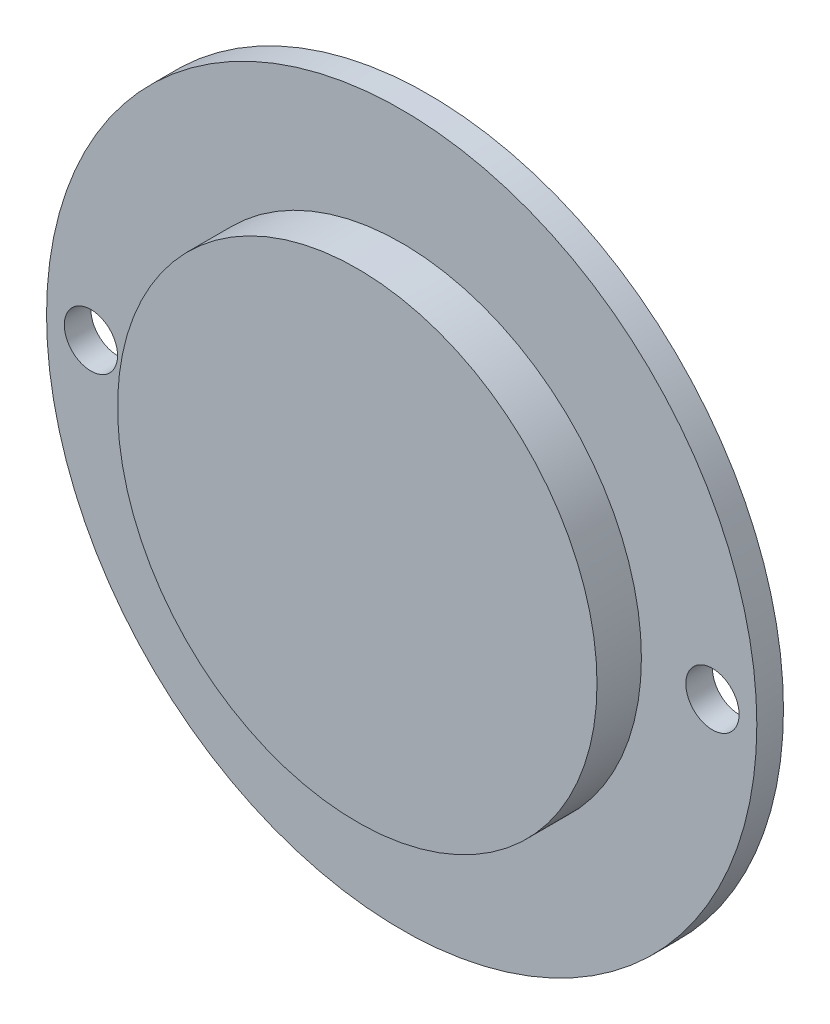
ISO-10303-21;
HEADER;
FILE_DESCRIPTION(('STEP AP214'),'2;1');
FILE_NAME('part.step','',(''),(''),'','','');
FILE_SCHEMA(('AUTOMOTIVE_DESIGN { 1 0 10303 214 1 1 1 1 }'));
ENDSEC;
DATA;
#1=APPLICATION_CONTEXT('core data for automotive mechanical design processes');
#2=APPLICATION_PROTOCOL_DEFINITION('international standard','automotive_design',2000,#1);
#3=PRODUCT_CONTEXT('',#1,'mechanical');
#4=PRODUCT('Part','Part','',(#3));
#5=PRODUCT_RELATED_PRODUCT_CATEGORY('part','',(#4));
#6=PRODUCT_DEFINITION_FORMATION('','',#4);
#7=PRODUCT_DEFINITION_CONTEXT('part definition',#1,'design');
#8=PRODUCT_DEFINITION('design','',#6,#7);
#9=PRODUCT_DEFINITION_SHAPE('','',#8);
#10=(LENGTH_UNIT() NAMED_UNIT(*) SI_UNIT(.MILLI.,.METRE.));
#11=(NAMED_UNIT(*) PLANE_ANGLE_UNIT() SI_UNIT($,.RADIAN.));
#12=(NAMED_UNIT(*) SI_UNIT($,.STERADIAN.) SOLID_ANGLE_UNIT());
#13=UNCERTAINTY_MEASURE_WITH_UNIT(LENGTH_MEASURE(1.E-05),#10,'distance_accuracy_value','');
#14=(GEOMETRIC_REPRESENTATION_CONTEXT(3) GLOBAL_UNCERTAINTY_ASSIGNED_CONTEXT((#13)) GLOBAL_UNIT_ASSIGNED_CONTEXT((#10,
#11,#12)) REPRESENTATION_CONTEXT('',''));
#15=CARTESIAN_POINT('',(0.,0.,0.));
#16=DIRECTION('',(0.,0.,1.));
#17=DIRECTION('',(1.,0.,0.));
#18=AXIS2_PLACEMENT_3D('',#15,#16,#17);
#19=CARTESIAN_POINT('',(0.,0.,3.));
#20=DIRECTION('',(0.,0.,1.));
#21=DIRECTION('',(1.,0.,0.));
#22=AXIS2_PLACEMENT_3D('',#19,#20,#21);
#23=PLANE('',#22);
#24=CARTESIAN_POINT('',(35.,0.,3.));
#25=DIRECTION('',(0.,0.,1.));
#26=DIRECTION('',(1.,0.,0.));
#27=AXIS2_PLACEMENT_3D('',#24,#25,#26);
#28=CIRCLE('',#27,3.);
#29=CARTESIAN_POINT('',(38.,0.,3.));
#30=VERTEX_POINT('',#29);
#31=EDGE_CURVE('E56',#30,#30,#28,.T.);
#32=ORIENTED_EDGE('',*,*,#31,.F.);
#33=EDGE_LOOP('',(#32));
#34=FACE_BOUND('',#33,.T.);
#35=CARTESIAN_POINT('',(-35.,0.,3.));
#36=DIRECTION('',(0.,0.,1.));
#37=DIRECTION('',(1.,0.,0.));
#38=AXIS2_PLACEMENT_3D('',#35,#36,#37);
#39=CIRCLE('',#38,3.);
#40=CARTESIAN_POINT('',(-32.,0.,3.));
#41=VERTEX_POINT('',#40);
#42=EDGE_CURVE('E48',#41,#41,#39,.T.);
#43=ORIENTED_EDGE('',*,*,#42,.F.);
#44=EDGE_LOOP('',(#43));
#45=FACE_BOUND('',#44,.T.);
#46=CARTESIAN_POINT('',(0.,0.,3.));
#47=DIRECTION('',(0.,0.,1.));
#48=DIRECTION('',(1.,0.,0.));
#49=AXIS2_PLACEMENT_3D('',#46,#47,#48);
#50=CIRCLE('',#49,40.);
#51=CARTESIAN_POINT('',(40.,0.,3.));
#52=VERTEX_POINT('',#51);
#53=EDGE_CURVE('E10',#52,#52,#50,.T.);
#54=ORIENTED_EDGE('',*,*,#53,.T.);
#55=EDGE_LOOP('',(#54));
#56=FACE_BOUND('',#55,.T.);
#57=CARTESIAN_POINT('',(0.,0.,3.));
#58=DIRECTION('',(0.,0.,1.));
#59=DIRECTION('',(1.,0.,0.));
#60=AXIS2_PLACEMENT_3D('',#57,#58,#59);
#61=CIRCLE('',#60,27.);
#62=CARTESIAN_POINT('',(27.,0.,3.));
#63=VERTEX_POINT('',#62);
#64=EDGE_CURVE('E45',#63,#63,#61,.T.);
#65=ORIENTED_EDGE('',*,*,#64,.F.);
#66=EDGE_LOOP('',(#65));
#67=FACE_BOUND('',#66,.T.);
#68=ADVANCED_FACE('F32',(#34,#45,#56,#67),#23,.T.);
#69=CARTESIAN_POINT('',(0.,0.,3.));
#70=DIRECTION('',(0.,0.,-1.));
#71=DIRECTION('',(-1.,0.,0.));
#72=AXIS2_PLACEMENT_3D('',#69,#70,#71);
#73=CYLINDRICAL_SURFACE('',#72,40.);
#74=ORIENTED_EDGE('',*,*,#53,.F.);
#75=EDGE_LOOP('',(#74));
#76=FACE_BOUND('',#75,.T.);
#77=CARTESIAN_POINT('',(0.,0.,0.));
#78=DIRECTION('',(0.,0.,1.));
#79=DIRECTION('',(1.,0.,0.));
#80=AXIS2_PLACEMENT_3D('',#77,#78,#79);
#81=CIRCLE('',#80,40.);
#82=CARTESIAN_POINT('',(40.,0.,0.));
#83=VERTEX_POINT('',#82);
#84=EDGE_CURVE('E36',#83,#83,#81,.T.);
#85=ORIENTED_EDGE('',*,*,#84,.T.);
#86=EDGE_LOOP('',(#85));
#87=FACE_BOUND('',#86,.T.);
#88=ADVANCED_FACE('F34',(#76,#87),#73,.T.);
#89=CARTESIAN_POINT('',(0.,0.,0.));
#90=DIRECTION('',(0.,0.,1.));
#91=DIRECTION('',(1.,0.,0.));
#92=AXIS2_PLACEMENT_3D('',#89,#90,#91);
#93=PLANE('',#92);
#94=CARTESIAN_POINT('',(35.,0.,0.));
#95=DIRECTION('',(0.,0.,-1.));
#96=DIRECTION('',(1.,0.,0.));
#97=AXIS2_PLACEMENT_3D('',#94,#95,#96);
#98=CIRCLE('',#97,3.);
#99=CARTESIAN_POINT('',(38.,0.,0.));
#100=VERTEX_POINT('',#99);
#101=EDGE_CURVE('E59',#100,#100,#98,.T.);
#102=ORIENTED_EDGE('',*,*,#101,.F.);
#103=EDGE_LOOP('',(#102));
#104=FACE_BOUND('',#103,.T.);
#105=CARTESIAN_POINT('',(-35.,0.,0.));
#106=DIRECTION('',(0.,0.,-1.));
#107=DIRECTION('',(-1.,0.,0.));
#108=AXIS2_PLACEMENT_3D('',#105,#106,#107);
#109=CIRCLE('',#108,3.);
#110=CARTESIAN_POINT('',(-38.,0.,0.));
#111=VERTEX_POINT('',#110);
#112=EDGE_CURVE('E53',#111,#111,#109,.T.);
#113=ORIENTED_EDGE('',*,*,#112,.F.);
#114=EDGE_LOOP('',(#113));
#115=FACE_BOUND('',#114,.T.);
#116=ORIENTED_EDGE('',*,*,#84,.F.);
#117=EDGE_LOOP('',(#116));
#118=FACE_BOUND('',#117,.T.);
#119=ADVANCED_FACE('F65',(#104,#115,#118),#93,.F.);
#120=CARTESIAN_POINT('',(0.,0.,8.));
#121=DIRECTION('',(0.,0.,-1.));
#122=DIRECTION('',(-1.,0.,0.));
#123=AXIS2_PLACEMENT_3D('',#120,#121,#122);
#124=CYLINDRICAL_SURFACE('',#123,27.);
#125=CARTESIAN_POINT('',(0.,0.,8.));
#126=DIRECTION('',(0.,0.,1.));
#127=DIRECTION('',(1.,0.,0.));
#128=AXIS2_PLACEMENT_3D('',#125,#126,#127);
#129=CIRCLE('',#128,27.);
#130=CARTESIAN_POINT('',(27.,0.,8.));
#131=VERTEX_POINT('',#130);
#132=EDGE_CURVE('E43',#131,#131,#129,.T.);
#133=ORIENTED_EDGE('',*,*,#132,.F.);
#134=EDGE_LOOP('',(#133));
#135=FACE_BOUND('',#134,.T.);
#136=ORIENTED_EDGE('',*,*,#64,.T.);
#137=EDGE_LOOP('',(#136));
#138=FACE_BOUND('',#137,.T.);
#139=ADVANCED_FACE('F68',(#135,#138),#124,.T.);
#140=CARTESIAN_POINT('',(0.,0.,8.));
#141=DIRECTION('',(0.,0.,1.));
#142=DIRECTION('',(1.,0.,0.));
#143=AXIS2_PLACEMENT_3D('',#140,#141,#142);
#144=PLANE('',#143);
#145=ORIENTED_EDGE('',*,*,#132,.T.);
#146=EDGE_LOOP('',(#145));
#147=FACE_BOUND('',#146,.T.);
#148=ADVANCED_FACE('F87',(#147),#144,.T.);
#149=CARTESIAN_POINT('',(-35.,0.,5.));
#150=DIRECTION('',(0.,0.,-1.));
#151=DIRECTION('',(-1.,0.,0.));
#152=AXIS2_PLACEMENT_3D('',#149,#150,#151);
#153=CYLINDRICAL_SURFACE('',#152,3.);
#154=ORIENTED_EDGE('',*,*,#42,.T.);
#155=EDGE_LOOP('',(#154));
#156=FACE_BOUND('',#155,.T.);
#157=ORIENTED_EDGE('',*,*,#112,.T.);
#158=EDGE_LOOP('',(#157));
#159=FACE_BOUND('',#158,.T.);
#160=ADVANCED_FACE('F91',(#156,#159),#153,.F.);
#161=CARTESIAN_POINT('',(35.,0.,5.));
#162=DIRECTION('',(0.,0.,-1.));
#163=DIRECTION('',(-1.,0.,0.));
#164=AXIS2_PLACEMENT_3D('',#161,#162,#163);
#165=CYLINDRICAL_SURFACE('',#164,3.);
#166=ORIENTED_EDGE('',*,*,#31,.T.);
#167=EDGE_LOOP('',(#166));
#168=FACE_BOUND('',#167,.T.);
#169=ORIENTED_EDGE('',*,*,#101,.T.);
#170=EDGE_LOOP('',(#169));
#171=FACE_BOUND('',#170,.T.);
#172=ADVANCED_FACE('F63',(#168,#171),#165,.F.);
#173=CLOSED_SHELL('',(#68,#88,#119,#139,#148,#160,#172));
#174=MANIFOLD_SOLID_BREP('B2',#173);
#175=ADVANCED_BREP_SHAPE_REPRESENTATION('',(#18,#174),#14);
#176=SHAPE_DEFINITION_REPRESENTATION(#9,#175);
ENDSEC;
END-ISO-10303-21;
